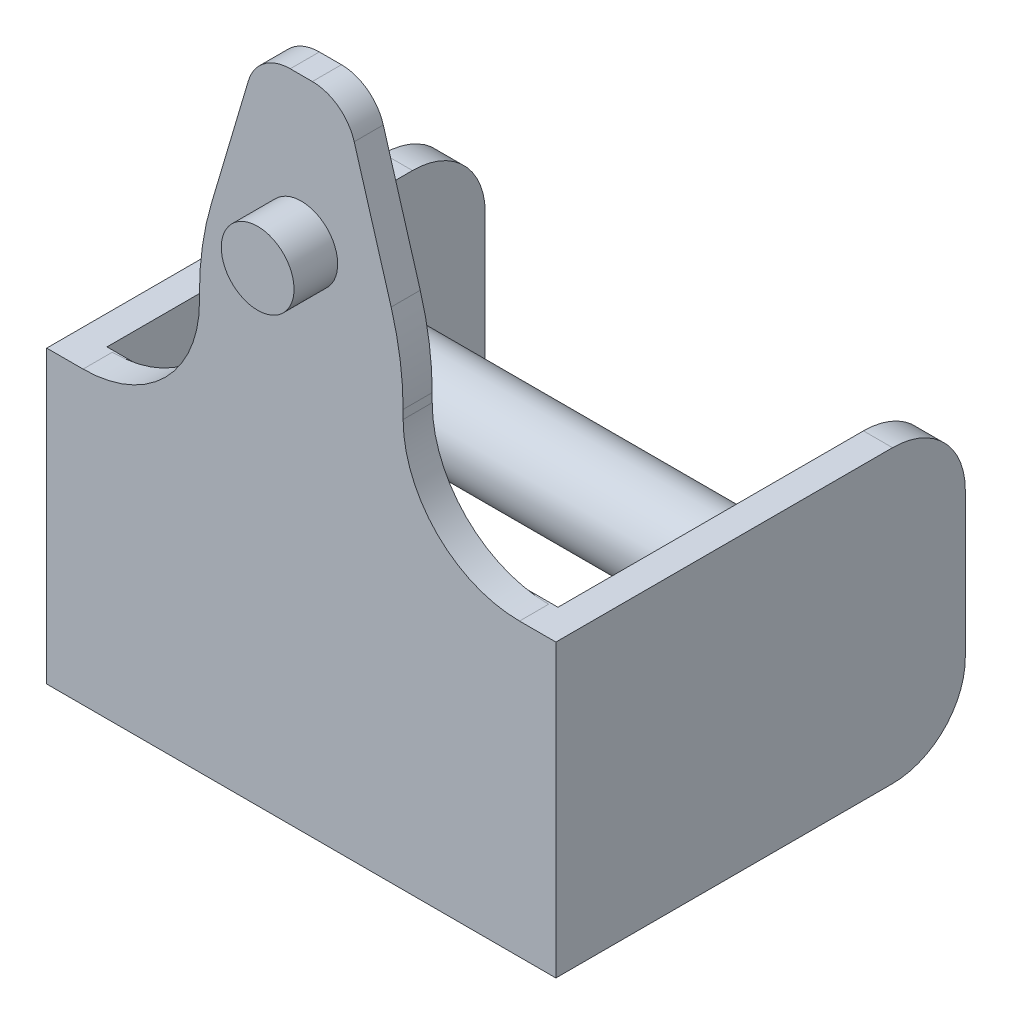
ISO-10303-21;
HEADER;
FILE_DESCRIPTION(('STEP AP214'),'2;1');
FILE_NAME('part.step','',(''),(''),'','','');
FILE_SCHEMA(('AUTOMOTIVE_DESIGN { 1 0 10303 214 1 1 1 1 }'));
ENDSEC;
DATA;
#1=APPLICATION_CONTEXT('core data for automotive mechanical design processes');
#2=APPLICATION_PROTOCOL_DEFINITION('international standard','automotive_design',2000,#1);
#3=PRODUCT_CONTEXT('',#1,'mechanical');
#4=PRODUCT('Part','Part','',(#3));
#5=PRODUCT_RELATED_PRODUCT_CATEGORY('part','',(#4));
#6=PRODUCT_DEFINITION_FORMATION('','',#4);
#7=PRODUCT_DEFINITION_CONTEXT('part definition',#1,'design');
#8=PRODUCT_DEFINITION('design','',#6,#7);
#9=PRODUCT_DEFINITION_SHAPE('','',#8);
#10=(LENGTH_UNIT() NAMED_UNIT(*) SI_UNIT(.MILLI.,.METRE.));
#11=(NAMED_UNIT(*) PLANE_ANGLE_UNIT() SI_UNIT($,.RADIAN.));
#12=(NAMED_UNIT(*) SI_UNIT($,.STERADIAN.) SOLID_ANGLE_UNIT());
#13=UNCERTAINTY_MEASURE_WITH_UNIT(LENGTH_MEASURE(1.E-05),#10,'distance_accuracy_value','');
#14=(GEOMETRIC_REPRESENTATION_CONTEXT(3) GLOBAL_UNCERTAINTY_ASSIGNED_CONTEXT((#13)) GLOBAL_UNIT_ASSIGNED_CONTEXT((#10,
#11,#12)) REPRESENTATION_CONTEXT('',''));
#15=CARTESIAN_POINT('',(0.,0.,0.));
#16=DIRECTION('',(0.,0.,1.));
#17=DIRECTION('',(1.,0.,0.));
#18=AXIS2_PLACEMENT_3D('',#15,#16,#17);
#19=CARTESIAN_POINT('',(-15.5,-10.,18.));
#20=DIRECTION('',(0.,0.,1.));
#21=DIRECTION('',(1.,0.,0.));
#22=AXIS2_PLACEMENT_3D('',#19,#20,#21);
#23=PLANE('',#22);
#24=DIRECTION('',(1.,0.,0.));
#25=VECTOR('',#24,1.);
#26=CARTESIAN_POINT('',(-15.5,10.,18.));
#27=LINE('',#26,#25);
#28=CARTESIAN_POINT('',(-15.5,10.,18.));
#29=VERTEX_POINT('',#28);
#30=CARTESIAN_POINT('',(15.5,10.,18.));
#31=VERTEX_POINT('',#30);
#32=EDGE_CURVE('E201',#29,#31,#27,.T.);
#33=ORIENTED_EDGE('',*,*,#32,.T.);
#34=DIRECTION('',(0.,1.,0.));
#35=VECTOR('',#34,1.);
#36=CARTESIAN_POINT('',(15.5,-10.,18.));
#37=LINE('',#36,#35);
#38=CARTESIAN_POINT('',(15.5,-10.,18.));
#39=VERTEX_POINT('',#38);
#40=EDGE_CURVE('E260',#39,#31,#37,.T.);
#41=ORIENTED_EDGE('',*,*,#40,.F.);
#42=DIRECTION('',(1.,0.,0.));
#43=VECTOR('',#42,1.);
#44=CARTESIAN_POINT('',(-15.5,-10.,18.));
#45=LINE('',#44,#43);
#46=CARTESIAN_POINT('',(-15.5,-10.,18.));
#47=VERTEX_POINT('',#46);
#48=EDGE_CURVE('E215',#47,#39,#45,.T.);
#49=ORIENTED_EDGE('',*,*,#48,.F.);
#50=DIRECTION('',(0.,1.,0.));
#51=VECTOR('',#50,1.);
#52=CARTESIAN_POINT('',(-15.5,-10.,18.));
#53=LINE('',#52,#51);
#54=EDGE_CURVE('E224',#47,#29,#53,.T.);
#55=ORIENTED_EDGE('',*,*,#54,.T.);
#56=EDGE_LOOP('',(#33,#41,#49,#55));
#57=FACE_BOUND('',#56,.T.);
#58=ADVANCED_FACE('F15',(#57),#23,.F.);
#59=CARTESIAN_POINT('',(15.5,-10.,0.));
#60=DIRECTION('',(1.,0.,0.));
#61=DIRECTION('',(0.,0.,-1.));
#62=AXIS2_PLACEMENT_3D('',#59,#60,#61);
#63=PLANE('',#62);
#64=CARTESIAN_POINT('',(15.5,0.,0.));
#65=DIRECTION('',(1.,0.,0.));
#66=DIRECTION('',(0.,0.,-1.));
#67=AXIS2_PLACEMENT_3D('',#64,#65,#66);
#68=CIRCLE('',#67,3.025);
#69=CARTESIAN_POINT('',(15.5,0.,-3.025));
#70=VERTEX_POINT('',#69);
#71=EDGE_CURVE('E263',#70,#70,#68,.F.);
#72=ORIENTED_EDGE('',*,*,#71,.F.);
#73=EDGE_LOOP('',(#72));
#74=FACE_BOUND('',#73,.T.);
#75=DIRECTION('',(0.,1.,0.));
#76=VECTOR('',#75,1.);
#77=CARTESIAN_POINT('',(15.5,-10.,-8.));
#78=LINE('',#77,#76);
#79=CARTESIAN_POINT('',(15.5,-5.,-8.));
#80=VERTEX_POINT('',#79);
#81=CARTESIAN_POINT('',(15.5,5.,-8.));
#82=VERTEX_POINT('',#81);
#83=EDGE_CURVE('E258',#80,#82,#78,.T.);
#84=ORIENTED_EDGE('',*,*,#83,.F.);
#85=CARTESIAN_POINT('',(15.5,-5.,-3.));
#86=DIRECTION('',(1.,0.,0.));
#87=DIRECTION('',(0.,0.,-1.));
#88=AXIS2_PLACEMENT_3D('',#85,#86,#87);
#89=CIRCLE('',#88,5.);
#90=CARTESIAN_POINT('',(15.5,-10.,-3.));
#91=VERTEX_POINT('',#90);
#92=EDGE_CURVE('E287',#80,#91,#89,.F.);
#93=ORIENTED_EDGE('',*,*,#92,.T.);
#94=DIRECTION('',(0.,0.,-1.));
#95=VECTOR('',#94,1.);
#96=CARTESIAN_POINT('',(15.5,-10.,18.));
#97=LINE('',#96,#95);
#98=EDGE_CURVE('E211',#39,#91,#97,.T.);
#99=ORIENTED_EDGE('',*,*,#98,.F.);
#100=ORIENTED_EDGE('',*,*,#40,.T.);
#101=DIRECTION('',(0.,0.,-1.));
#102=VECTOR('',#101,1.);
#103=CARTESIAN_POINT('',(15.5,10.,0.));
#104=LINE('',#103,#102);
#105=CARTESIAN_POINT('',(15.5,10.,-3.));
#106=VERTEX_POINT('',#105);
#107=EDGE_CURVE('E205',#31,#106,#104,.T.);
#108=ORIENTED_EDGE('',*,*,#107,.T.);
#109=CARTESIAN_POINT('',(15.5,5.,-3.));
#110=DIRECTION('',(1.,0.,0.));
#111=DIRECTION('',(0.,0.,-1.));
#112=AXIS2_PLACEMENT_3D('',#109,#110,#111);
#113=CIRCLE('',#112,5.);
#114=EDGE_CURVE('E277',#106,#82,#113,.F.);
#115=ORIENTED_EDGE('',*,*,#114,.T.);
#116=EDGE_LOOP('',(#84,#93,#99,#100,#108,#115));
#117=FACE_BOUND('',#116,.T.);
#118=ADVANCED_FACE('F455',(#74,#117),#63,.F.);
#119=CARTESIAN_POINT('',(15.5,-10.,-8.));
#120=DIRECTION('',(0.,0.,1.));
#121=DIRECTION('',(1.,0.,0.));
#122=AXIS2_PLACEMENT_3D('',#119,#120,#121);
#123=PLANE('',#122);
#124=DIRECTION('',(0.,1.,0.));
#125=VECTOR('',#124,1.);
#126=CARTESIAN_POINT('',(17.5,-10.,-8.));
#127=LINE('',#126,#125);
#128=CARTESIAN_POINT('',(17.5,-5.,-8.));
#129=VERTEX_POINT('',#128);
#130=CARTESIAN_POINT('',(17.5,5.,-8.));
#131=VERTEX_POINT('',#130);
#132=EDGE_CURVE('E256',#129,#131,#127,.T.);
#133=ORIENTED_EDGE('',*,*,#132,.F.);
#134=DIRECTION('',(1.,0.,0.));
#135=VECTOR('',#134,1.);
#136=CARTESIAN_POINT('',(15.5,-5.,-8.));
#137=LINE('',#136,#135);
#138=EDGE_CURVE('E285',#129,#80,#137,.F.);
#139=ORIENTED_EDGE('',*,*,#138,.T.);
#140=ORIENTED_EDGE('',*,*,#83,.T.);
#141=DIRECTION('',(1.,0.,0.));
#142=VECTOR('',#141,1.);
#143=CARTESIAN_POINT('',(17.5,5.,-8.));
#144=LINE('',#143,#142);
#145=EDGE_CURVE('E270',#82,#131,#144,.T.);
#146=ORIENTED_EDGE('',*,*,#145,.T.);
#147=EDGE_LOOP('',(#133,#139,#140,#146));
#148=FACE_BOUND('',#147,.T.);
#149=ADVANCED_FACE('F463',(#148),#123,.F.);
#150=CARTESIAN_POINT('',(17.5,-10.,18.));
#151=DIRECTION('',(-1.,0.,0.));
#152=DIRECTION('',(0.,0.,1.));
#153=AXIS2_PLACEMENT_3D('',#150,#151,#152);
#154=PLANE('',#153);
#155=DIRECTION('',(0.,0.,1.));
#156=VECTOR('',#155,1.);
#157=CARTESIAN_POINT('',(17.5,10.,18.));
#158=LINE('',#157,#156);
#159=CARTESIAN_POINT('',(17.5,10.,-3.));
#160=VERTEX_POINT('',#159);
#161=CARTESIAN_POINT('',(17.5,10.,20.1428278468085));
#162=VERTEX_POINT('',#161);
#163=EDGE_CURVE('E231',#160,#162,#158,.T.);
#164=ORIENTED_EDGE('',*,*,#163,.T.);
#165=DIRECTION('',(0.,1.,0.));
#166=VECTOR('',#165,1.);
#167=CARTESIAN_POINT('',(17.5,-10.,20.1428278468085));
#168=LINE('',#167,#166);
#169=CARTESIAN_POINT('',(17.5,-10.,20.1428278468085));
#170=VERTEX_POINT('',#169);
#171=EDGE_CURVE('E254',#170,#162,#168,.T.);
#172=ORIENTED_EDGE('',*,*,#171,.F.);
#173=DIRECTION('',(0.,0.,1.));
#174=VECTOR('',#173,1.);
#175=CARTESIAN_POINT('',(17.5,-10.,-8.));
#176=LINE('',#175,#174);
#177=CARTESIAN_POINT('',(17.5,-10.,-3.));
#178=VERTEX_POINT('',#177);
#179=EDGE_CURVE('E214',#178,#170,#176,.T.);
#180=ORIENTED_EDGE('',*,*,#179,.F.);
#181=CARTESIAN_POINT('',(17.5,-5.,-3.));
#182=DIRECTION('',(-1.,0.,0.));
#183=DIRECTION('',(0.,0.,1.));
#184=AXIS2_PLACEMENT_3D('',#181,#182,#183);
#185=CIRCLE('',#184,5.);
#186=EDGE_CURVE('E283',#178,#129,#185,.F.);
#187=ORIENTED_EDGE('',*,*,#186,.T.);
#188=ORIENTED_EDGE('',*,*,#132,.T.);
#189=CARTESIAN_POINT('',(17.5,5.,-3.));
#190=DIRECTION('',(-1.,0.,0.));
#191=DIRECTION('',(0.,0.,1.));
#192=AXIS2_PLACEMENT_3D('',#189,#190,#191);
#193=CIRCLE('',#192,5.);
#194=EDGE_CURVE('E273',#131,#160,#193,.F.);
#195=ORIENTED_EDGE('',*,*,#194,.T.);
#196=EDGE_LOOP('',(#164,#172,#180,#187,#188,#195));
#197=FACE_BOUND('',#196,.T.);
#198=ADVANCED_FACE('F446',(#197),#154,.F.);
#199=CARTESIAN_POINT('',(-17.5,-10.,20.1428278468085));
#200=DIRECTION('',(0.,0.,-1.));
#201=DIRECTION('',(-1.,0.,0.));
#202=AXIS2_PLACEMENT_3D('',#199,#200,#201);
#203=PLANE('',#202);
#204=CARTESIAN_POINT('',(0.,24.9999999999999,20.1428278468085));
#205=DIRECTION('',(0.,0.,-1.));
#206=DIRECTION('',(0.,-1.,0.));
#207=AXIS2_PLACEMENT_3D('',#204,#205,#206);
#208=CIRCLE('',#207,2.5);
#209=CARTESIAN_POINT('',(0.,22.4999999999999,20.1428278468085));
#210=VERTEX_POINT('',#209);
#211=EDGE_CURVE('E388',#210,#210,#208,.T.);
#212=ORIENTED_EDGE('',*,*,#211,.T.);
#213=EDGE_LOOP('',(#212));
#214=FACE_BOUND('',#213,.T.);
#215=DIRECTION('',(-1.,0.,0.));
#216=VECTOR('',#215,1.);
#217=CARTESIAN_POINT('',(-17.5,10.,20.1428278468085));
#218=LINE('',#217,#216);
#219=CARTESIAN_POINT('',(-15.,10.,20.1428278468085));
#220=VERTEX_POINT('',#219);
#221=CARTESIAN_POINT('',(-17.5,10.,20.1428278468085));
#222=VERTEX_POINT('',#221);
#223=EDGE_CURVE('E235',#220,#222,#218,.T.);
#224=ORIENTED_EDGE('',*,*,#223,.T.);
#225=DIRECTION('',(0.,1.,0.));
#226=VECTOR('',#225,1.);
#227=CARTESIAN_POINT('',(-17.5,-10.,20.1428278468085));
#228=LINE('',#227,#226);
#229=CARTESIAN_POINT('',(-17.5,-10.,20.1428278468085));
#230=VERTEX_POINT('',#229);
#231=EDGE_CURVE('E252',#230,#222,#228,.T.);
#232=ORIENTED_EDGE('',*,*,#231,.F.);
#233=DIRECTION('',(-1.,0.,0.));
#234=VECTOR('',#233,1.);
#235=CARTESIAN_POINT('',(-17.5,-10.,20.1428278468085));
#236=LINE('',#235,#234);
#237=EDGE_CURVE('E217',#170,#230,#236,.T.);
#238=ORIENTED_EDGE('',*,*,#237,.F.);
#239=ORIENTED_EDGE('',*,*,#171,.T.);
#240=CARTESIAN_POINT('',(15.,10.,20.1428278468085));
#241=VERTEX_POINT('',#240);
#242=EDGE_CURVE('E236',#162,#241,#218,.T.);
#243=ORIENTED_EDGE('',*,*,#242,.T.);
#244=CARTESIAN_POINT('',(15.,18.,20.1428278468085));
#245=DIRECTION('',(0.,0.,1.));
#246=DIRECTION('',(0.,1.,0.));
#247=AXIS2_PLACEMENT_3D('',#244,#245,#246);
#248=CIRCLE('',#247,8.);
#249=CARTESIAN_POINT('',(7.,18.,20.1428278468085));
#250=VERTEX_POINT('',#249);
#251=EDGE_CURVE('E352',#250,#241,#248,.T.);
#252=ORIENTED_EDGE('',*,*,#251,.F.);
#253=DIRECTION('',(0.,-1.,0.));
#254=VECTOR('',#253,1.);
#255=CARTESIAN_POINT('',(7.,21.5,20.1428278468085));
#256=LINE('',#255,#254);
#257=CARTESIAN_POINT('',(7.,18.5993607983564,20.1428278468085));
#258=VERTEX_POINT('',#257);
#259=EDGE_CURVE('E347',#258,#250,#256,.T.);
#260=ORIENTED_EDGE('',*,*,#259,.F.);
#261=CARTESIAN_POINT('',(-13.,18.5993607983564,20.1428278468085));
#262=DIRECTION('',(0.,0.,-1.));
#263=DIRECTION('',(0.,-1.,0.));
#264=AXIS2_PLACEMENT_3D('',#261,#262,#263);
#265=CIRCLE('',#264,20.);
#266=CARTESIAN_POINT('',(6.17596225416774,24.2811273921839,20.1428278468085));
#267=VERTEX_POINT('',#266);
#268=EDGE_CURVE('E200',#267,#258,#265,.T.);
#269=ORIENTED_EDGE('',*,*,#268,.F.);
#270=DIRECTION('',(0.284088329691376,-0.958798112708387,0.));
#271=VECTOR('',#270,1.);
#272=CARTESIAN_POINT('',(3.,34.9999999999999,20.1428278468085));
#273=LINE('',#272,#271);
#274=CARTESIAN_POINT('',(3.63636592916322,32.852264989074,20.1428278468085));
#275=VERTEX_POINT('',#274);
#276=EDGE_CURVE('E196',#275,#267,#273,.T.);
#277=ORIENTED_EDGE('',*,*,#276,.F.);
#278=CARTESIAN_POINT('',(0.759971591038062,31.9999999999999,20.1428278468085));
#279=DIRECTION('',(0.,0.,-1.));
#280=DIRECTION('',(0.,-1.,0.));
#281=AXIS2_PLACEMENT_3D('',#278,#279,#280);
#282=CIRCLE('',#281,3.);
#283=CARTESIAN_POINT('',(0.759971591038064,34.9999999999999,20.1428278468085));
#284=VERTEX_POINT('',#283);
#285=EDGE_CURVE('E380',#284,#275,#282,.T.);
#286=ORIENTED_EDGE('',*,*,#285,.F.);
#287=DIRECTION('',(1.,0.,0.));
#288=VECTOR('',#287,1.);
#289=CARTESIAN_POINT('',(0.,34.9999999999999,20.1428278468085));
#290=LINE('',#289,#288);
#291=CARTESIAN_POINT('',(-0.759971591038069,34.9999999999999,20.1428278468085));
#292=VERTEX_POINT('',#291);
#293=EDGE_CURVE('E376',#292,#284,#290,.T.);
#294=ORIENTED_EDGE('',*,*,#293,.F.);
#295=CARTESIAN_POINT('',(-0.759971591038069,31.9999999999999,20.1428278468085));
#296=DIRECTION('',(0.,0.,-1.));
#297=DIRECTION('',(0.,-1.,0.));
#298=AXIS2_PLACEMENT_3D('',#295,#296,#297);
#299=CIRCLE('',#298,3.);
#300=CARTESIAN_POINT('',(-3.63636592916323,32.852264989074,20.1428278468085));
#301=VERTEX_POINT('',#300);
#302=EDGE_CURVE('E371',#301,#292,#299,.T.);
#303=ORIENTED_EDGE('',*,*,#302,.F.);
#304=DIRECTION('',(0.284088329691375,0.958798112708387,0.));
#305=VECTOR('',#304,1.);
#306=CARTESIAN_POINT('',(-3.,34.9999999999999,20.1428278468085));
#307=LINE('',#306,#305);
#308=CARTESIAN_POINT('',(-6.17596225416773,24.2811273921839,20.1428278468085));
#309=VERTEX_POINT('',#308);
#310=EDGE_CURVE('E367',#309,#301,#307,.T.);
#311=ORIENTED_EDGE('',*,*,#310,.F.);
#312=CARTESIAN_POINT('',(13.,18.5993607983564,20.1428278468085));
#313=DIRECTION('',(0.,0.,-1.));
#314=DIRECTION('',(0.,-1.,0.));
#315=AXIS2_PLACEMENT_3D('',#312,#313,#314);
#316=CIRCLE('',#315,20.);
#317=CARTESIAN_POINT('',(-7.,18.5993607983564,20.1428278468085));
#318=VERTEX_POINT('',#317);
#319=EDGE_CURVE('E363',#318,#309,#316,.T.);
#320=ORIENTED_EDGE('',*,*,#319,.F.);
#321=DIRECTION('',(0.,1.,0.));
#322=VECTOR('',#321,1.);
#323=CARTESIAN_POINT('',(-7.,21.5,20.1428278468085));
#324=LINE('',#323,#322);
#325=CARTESIAN_POINT('',(-7.,18.,20.1428278468085));
#326=VERTEX_POINT('',#325);
#327=EDGE_CURVE('E359',#326,#318,#324,.T.);
#328=ORIENTED_EDGE('',*,*,#327,.F.);
#329=CARTESIAN_POINT('',(-15.,18.,20.1428278468085));
#330=DIRECTION('',(0.,0.,1.));
#331=DIRECTION('',(0.,1.,0.));
#332=AXIS2_PLACEMENT_3D('',#329,#330,#331);
#333=CIRCLE('',#332,8.);
#334=EDGE_CURVE('E30',#220,#326,#333,.T.);
#335=ORIENTED_EDGE('',*,*,#334,.F.);
#336=EDGE_LOOP('',(#224,#232,#238,#239,#243,#252,#260,#269,#277,#286,#294,#303,#311,#320,#328,#335));
#337=FACE_BOUND('',#336,.T.);
#338=ADVANCED_FACE('F336',(#214,#337),#203,.F.);
#339=CARTESIAN_POINT('',(-17.5,-10.,-8.));
#340=DIRECTION('',(1.,0.,0.));
#341=DIRECTION('',(0.,0.,-1.));
#342=AXIS2_PLACEMENT_3D('',#339,#340,#341);
#343=PLANE('',#342);
#344=ORIENTED_EDGE('',*,*,#231,.T.);
#345=DIRECTION('',(0.,0.,-1.));
#346=VECTOR('',#345,1.);
#347=CARTESIAN_POINT('',(-17.5,10.,-8.));
#348=LINE('',#347,#346);
#349=CARTESIAN_POINT('',(-17.5,10.,-3.));
#350=VERTEX_POINT('',#349);
#351=EDGE_CURVE('E38',#222,#350,#348,.T.);
#352=ORIENTED_EDGE('',*,*,#351,.T.);
#353=CARTESIAN_POINT('',(-17.5,5.,-3.));
#354=DIRECTION('',(1.,0.,0.));
#355=DIRECTION('',(0.,0.,-1.));
#356=AXIS2_PLACEMENT_3D('',#353,#354,#355);
#357=CIRCLE('',#356,5.);
#358=CARTESIAN_POINT('',(-17.5,5.,-8.));
#359=VERTEX_POINT('',#358);
#360=EDGE_CURVE('E23',#350,#359,#357,.F.);
#361=ORIENTED_EDGE('',*,*,#360,.T.);
#362=DIRECTION('',(0.,1.,0.));
#363=VECTOR('',#362,1.);
#364=CARTESIAN_POINT('',(-17.5,-10.,-8.));
#365=LINE('',#364,#363);
#366=CARTESIAN_POINT('',(-17.5,-5.,-8.));
#367=VERTEX_POINT('',#366);
#368=EDGE_CURVE('E249',#367,#359,#365,.T.);
#369=ORIENTED_EDGE('',*,*,#368,.F.);
#370=CARTESIAN_POINT('',(-17.5,-5.,-3.));
#371=DIRECTION('',(1.,0.,0.));
#372=DIRECTION('',(0.,0.,-1.));
#373=AXIS2_PLACEMENT_3D('',#370,#371,#372);
#374=CIRCLE('',#373,5.);
#375=CARTESIAN_POINT('',(-17.5,-10.,-3.));
#376=VERTEX_POINT('',#375);
#377=EDGE_CURVE('E296',#367,#376,#374,.F.);
#378=ORIENTED_EDGE('',*,*,#377,.T.);
#379=DIRECTION('',(0.,0.,-1.));
#380=VECTOR('',#379,1.);
#381=CARTESIAN_POINT('',(-17.5,-10.,18.));
#382=LINE('',#381,#380);
#383=EDGE_CURVE('E219',#230,#376,#382,.T.);
#384=ORIENTED_EDGE('',*,*,#383,.F.);
#385=EDGE_LOOP('',(#344,#352,#361,#369,#378,#384));
#386=FACE_BOUND('',#385,.T.);
#387=ADVANCED_FACE('F306',(#386),#343,.F.);
#388=CARTESIAN_POINT('',(-15.5,-10.,-8.));
#389=DIRECTION('',(0.,0.,1.));
#390=DIRECTION('',(1.,0.,0.));
#391=AXIS2_PLACEMENT_3D('',#388,#389,#390);
#392=PLANE('',#391);
#393=ORIENTED_EDGE('',*,*,#368,.T.);
#394=DIRECTION('',(1.,0.,0.));
#395=VECTOR('',#394,1.);
#396=CARTESIAN_POINT('',(-15.5,5.,-8.));
#397=LINE('',#396,#395);
#398=CARTESIAN_POINT('',(-15.5,5.,-8.));
#399=VERTEX_POINT('',#398);
#400=EDGE_CURVE('E298',#359,#399,#397,.T.);
#401=ORIENTED_EDGE('',*,*,#400,.T.);
#402=DIRECTION('',(0.,1.,0.));
#403=VECTOR('',#402,1.);
#404=CARTESIAN_POINT('',(-15.5,-10.,-8.));
#405=LINE('',#404,#403);
#406=CARTESIAN_POINT('',(-15.5,-5.,-8.));
#407=VERTEX_POINT('',#406);
#408=EDGE_CURVE('E246',#407,#399,#405,.T.);
#409=ORIENTED_EDGE('',*,*,#408,.F.);
#410=DIRECTION('',(1.,0.,0.));
#411=VECTOR('',#410,1.);
#412=CARTESIAN_POINT('',(-15.5,-5.,-8.));
#413=LINE('',#412,#411);
#414=EDGE_CURVE('E294',#407,#367,#413,.F.);
#415=ORIENTED_EDGE('',*,*,#414,.T.);
#416=EDGE_LOOP('',(#393,#401,#409,#415));
#417=FACE_BOUND('',#416,.T.);
#418=ADVANCED_FACE('F312',(#417),#392,.F.);
#419=CARTESIAN_POINT('',(-15.5,-10.,18.));
#420=DIRECTION('',(-1.,0.,0.));
#421=DIRECTION('',(0.,0.,1.));
#422=AXIS2_PLACEMENT_3D('',#419,#420,#421);
#423=PLANE('',#422);
#424=CARTESIAN_POINT('',(-15.5,0.,0.));
#425=DIRECTION('',(-1.,0.,0.));
#426=DIRECTION('',(0.,1.,0.));
#427=AXIS2_PLACEMENT_3D('',#424,#425,#426);
#428=CIRCLE('',#427,3.025);
#429=CARTESIAN_POINT('',(-15.5,3.025,0.));
#430=VERTEX_POINT('',#429);
#431=EDGE_CURVE('E266',#430,#430,#428,.T.);
#432=ORIENTED_EDGE('',*,*,#431,.T.);
#433=EDGE_LOOP('',(#432));
#434=FACE_BOUND('',#433,.T.);
#435=ORIENTED_EDGE('',*,*,#408,.T.);
#436=CARTESIAN_POINT('',(-15.5,5.,-3.));
#437=DIRECTION('',(-1.,0.,0.));
#438=DIRECTION('',(0.,0.,1.));
#439=AXIS2_PLACEMENT_3D('',#436,#437,#438);
#440=CIRCLE('',#439,5.);
#441=CARTESIAN_POINT('',(-15.5,10.,-3.));
#442=VERTEX_POINT('',#441);
#443=EDGE_CURVE('E301',#399,#442,#440,.F.);
#444=ORIENTED_EDGE('',*,*,#443,.T.);
#445=DIRECTION('',(0.,0.,1.));
#446=VECTOR('',#445,1.);
#447=CARTESIAN_POINT('',(-15.5,10.,18.));
#448=LINE('',#447,#446);
#449=EDGE_CURVE('E227',#442,#29,#448,.T.);
#450=ORIENTED_EDGE('',*,*,#449,.T.);
#451=ORIENTED_EDGE('',*,*,#54,.F.);
#452=DIRECTION('',(0.,0.,1.));
#453=VECTOR('',#452,1.);
#454=CARTESIAN_POINT('',(-15.5,-10.,0.));
#455=LINE('',#454,#453);
#456=CARTESIAN_POINT('',(-15.5,-10.,-3.));
#457=VERTEX_POINT('',#456);
#458=EDGE_CURVE('E222',#457,#47,#455,.T.);
#459=ORIENTED_EDGE('',*,*,#458,.F.);
#460=CARTESIAN_POINT('',(-15.5,-5.,-3.));
#461=DIRECTION('',(-1.,0.,0.));
#462=DIRECTION('',(0.,0.,1.));
#463=AXIS2_PLACEMENT_3D('',#460,#461,#462);
#464=CIRCLE('',#463,5.);
#465=EDGE_CURVE('E292',#457,#407,#464,.F.);
#466=ORIENTED_EDGE('',*,*,#465,.T.);
#467=EDGE_LOOP('',(#435,#444,#450,#451,#459,#466));
#468=FACE_BOUND('',#467,.T.);
#469=ADVANCED_FACE('F317',(#434,#468),#423,.F.);
#470=CARTESIAN_POINT('',(0.,-10.,0.));
#471=DIRECTION('',(0.,1.,0.));
#472=DIRECTION('',(0.,0.,1.));
#473=AXIS2_PLACEMENT_3D('',#470,#471,#472);
#474=PLANE('',#473);
#475=ORIENTED_EDGE('',*,*,#383,.T.);
#476=DIRECTION('',(1.,0.,0.));
#477=VECTOR('',#476,1.);
#478=CARTESIAN_POINT('',(0.,-10.,-3.));
#479=LINE('',#478,#477);
#480=EDGE_CURVE('E289',#376,#457,#479,.T.);
#481=ORIENTED_EDGE('',*,*,#480,.T.);
#482=ORIENTED_EDGE('',*,*,#458,.T.);
#483=ORIENTED_EDGE('',*,*,#48,.T.);
#484=ORIENTED_EDGE('',*,*,#98,.T.);
#485=DIRECTION('',(1.,0.,0.));
#486=VECTOR('',#485,1.);
#487=CARTESIAN_POINT('',(0.,-10.,-3.));
#488=LINE('',#487,#486);
#489=EDGE_CURVE('E280',#91,#178,#488,.T.);
#490=ORIENTED_EDGE('',*,*,#489,.T.);
#491=ORIENTED_EDGE('',*,*,#179,.T.);
#492=ORIENTED_EDGE('',*,*,#237,.T.);
#493=EDGE_LOOP('',(#475,#481,#482,#483,#484,#490,#491,#492));
#494=FACE_BOUND('',#493,.T.);
#495=ADVANCED_FACE('F328',(#494),#474,.F.);
#496=CARTESIAN_POINT('',(0.,10.,0.));
#497=DIRECTION('',(0.,1.,0.));
#498=DIRECTION('',(0.,0.,1.));
#499=AXIS2_PLACEMENT_3D('',#496,#497,#498);
#500=PLANE('',#499);
#501=DIRECTION('',(-1.,0.,0.));
#502=VECTOR('',#501,1.);
#503=CARTESIAN_POINT('',(0.,10.,18.1428278468085));
#504=LINE('',#503,#502);
#505=CARTESIAN_POINT('',(15.,10.,18.1428278468085));
#506=VERTEX_POINT('',#505);
#507=CARTESIAN_POINT('',(-15.,10.,18.1428278468085));
#508=VERTEX_POINT('',#507);
#509=EDGE_CURVE('E9',#506,#508,#504,.T.);
#510=ORIENTED_EDGE('',*,*,#509,.F.);
#511=DIRECTION('',(0.,0.,1.));
#512=VECTOR('',#511,1.);
#513=CARTESIAN_POINT('',(15.,10.,18.1428278468085));
#514=LINE('',#513,#512);
#515=EDGE_CURVE('E207',#506,#241,#514,.T.);
#516=ORIENTED_EDGE('',*,*,#515,.T.);
#517=ORIENTED_EDGE('',*,*,#242,.F.);
#518=ORIENTED_EDGE('',*,*,#163,.F.);
#519=DIRECTION('',(1.,0.,0.));
#520=VECTOR('',#519,1.);
#521=CARTESIAN_POINT('',(15.5,10.,-3.));
#522=LINE('',#521,#520);
#523=EDGE_CURVE('E275',#160,#106,#522,.F.);
#524=ORIENTED_EDGE('',*,*,#523,.T.);
#525=ORIENTED_EDGE('',*,*,#107,.F.);
#526=ORIENTED_EDGE('',*,*,#32,.F.);
#527=ORIENTED_EDGE('',*,*,#449,.F.);
#528=DIRECTION('',(1.,0.,0.));
#529=VECTOR('',#528,1.);
#530=CARTESIAN_POINT('',(-17.5,10.,-3.));
#531=LINE('',#530,#529);
#532=EDGE_CURVE('E303',#442,#350,#531,.F.);
#533=ORIENTED_EDGE('',*,*,#532,.T.);
#534=ORIENTED_EDGE('',*,*,#351,.F.);
#535=ORIENTED_EDGE('',*,*,#223,.F.);
#536=DIRECTION('',(0.,0.,1.));
#537=VECTOR('',#536,1.);
#538=CARTESIAN_POINT('',(-15.,10.,18.1428278468085));
#539=LINE('',#538,#537);
#540=EDGE_CURVE('E436',#508,#220,#539,.T.);
#541=ORIENTED_EDGE('',*,*,#540,.F.);
#542=EDGE_LOOP('',(#510,#516,#517,#518,#524,#525,#526,#527,#533,#534,#535,#541));
#543=FACE_BOUND('',#542,.T.);
#544=ADVANCED_FACE('F322',(#543),#500,.T.);
#545=CARTESIAN_POINT('',(15.5,0.,0.));
#546=DIRECTION('',(-1.,0.,0.));
#547=DIRECTION('',(0.,0.,1.));
#548=AXIS2_PLACEMENT_3D('',#545,#546,#547);
#549=CYLINDRICAL_SURFACE('',#548,3.025);
#550=ORIENTED_EDGE('',*,*,#71,.T.);
#551=EDGE_LOOP('',(#550));
#552=FACE_BOUND('',#551,.T.);
#553=ORIENTED_EDGE('',*,*,#431,.F.);
#554=EDGE_LOOP('',(#553));
#555=FACE_BOUND('',#554,.T.);
#556=ADVANCED_FACE('F479',(#552,#555),#549,.T.);
#557=CARTESIAN_POINT('',(15.5,5.,-3.));
#558=DIRECTION('',(-1.,0.,0.));
#559=DIRECTION('',(0.,0.,1.));
#560=AXIS2_PLACEMENT_3D('',#557,#558,#559);
#561=CYLINDRICAL_SURFACE('',#560,5.);
#562=ORIENTED_EDGE('',*,*,#114,.F.);
#563=ORIENTED_EDGE('',*,*,#523,.F.);
#564=ORIENTED_EDGE('',*,*,#194,.F.);
#565=ORIENTED_EDGE('',*,*,#145,.F.);
#566=EDGE_LOOP('',(#562,#563,#564,#565));
#567=FACE_BOUND('',#566,.T.);
#568=ADVANCED_FACE('F451',(#567),#561,.T.);
#569=CARTESIAN_POINT('',(0.,-5.,-3.));
#570=DIRECTION('',(1.,0.,0.));
#571=DIRECTION('',(0.,0.,-1.));
#572=AXIS2_PLACEMENT_3D('',#569,#570,#571);
#573=CYLINDRICAL_SURFACE('',#572,5.);
#574=ORIENTED_EDGE('',*,*,#92,.F.);
#575=ORIENTED_EDGE('',*,*,#138,.F.);
#576=ORIENTED_EDGE('',*,*,#186,.F.);
#577=ORIENTED_EDGE('',*,*,#489,.F.);
#578=EDGE_LOOP('',(#574,#575,#576,#577));
#579=FACE_BOUND('',#578,.T.);
#580=ADVANCED_FACE('F459',(#579),#573,.T.);
#581=CARTESIAN_POINT('',(0.,-5.,-3.));
#582=DIRECTION('',(1.,0.,0.));
#583=DIRECTION('',(0.,0.,-1.));
#584=AXIS2_PLACEMENT_3D('',#581,#582,#583);
#585=CYLINDRICAL_SURFACE('',#584,5.);
#586=ORIENTED_EDGE('',*,*,#377,.F.);
#587=ORIENTED_EDGE('',*,*,#414,.F.);
#588=ORIENTED_EDGE('',*,*,#465,.F.);
#589=ORIENTED_EDGE('',*,*,#480,.F.);
#590=EDGE_LOOP('',(#586,#587,#588,#589));
#591=FACE_BOUND('',#590,.T.);
#592=ADVANCED_FACE('F332',(#591),#585,.T.);
#593=CARTESIAN_POINT('',(-15.5,5.,-3.));
#594=DIRECTION('',(-1.,0.,0.));
#595=DIRECTION('',(0.,0.,1.));
#596=AXIS2_PLACEMENT_3D('',#593,#594,#595);
#597=CYLINDRICAL_SURFACE('',#596,5.);
#598=ORIENTED_EDGE('',*,*,#360,.F.);
#599=ORIENTED_EDGE('',*,*,#532,.F.);
#600=ORIENTED_EDGE('',*,*,#443,.F.);
#601=ORIENTED_EDGE('',*,*,#400,.F.);
#602=EDGE_LOOP('',(#598,#599,#600,#601));
#603=FACE_BOUND('',#602,.T.);
#604=ADVANCED_FACE('F17',(#603),#597,.T.);
#605=CARTESIAN_POINT('',(-13.,18.5993607983564,18.1428278468085));
#606=DIRECTION('',(0.,0.,1.));
#607=DIRECTION('',(1.,0.,0.));
#608=AXIS2_PLACEMENT_3D('',#605,#606,#607);
#609=CYLINDRICAL_SURFACE('',#608,20.);
#610=ORIENTED_EDGE('',*,*,#268,.T.);
#611=DIRECTION('',(0.,0.,1.));
#612=VECTOR('',#611,1.);
#613=CARTESIAN_POINT('',(7.,18.5993607983564,18.1428278468085));
#614=LINE('',#613,#612);
#615=CARTESIAN_POINT('',(7.,18.5993607983564,18.1428278468085));
#616=VERTEX_POINT('',#615);
#617=EDGE_CURVE('E180',#616,#258,#614,.T.);
#618=ORIENTED_EDGE('',*,*,#617,.F.);
#619=CARTESIAN_POINT('',(-13.,18.5993607983564,18.1428278468085));
#620=DIRECTION('',(0.,0.,-1.));
#621=DIRECTION('',(0.,-1.,0.));
#622=AXIS2_PLACEMENT_3D('',#619,#620,#621);
#623=CIRCLE('',#622,20.);
#624=CARTESIAN_POINT('',(6.17596225416774,24.2811273921839,18.1428278468085));
#625=VERTEX_POINT('',#624);
#626=EDGE_CURVE('E187',#625,#616,#623,.T.);
#627=ORIENTED_EDGE('',*,*,#626,.F.);
#628=DIRECTION('',(0.,0.,1.));
#629=VECTOR('',#628,1.);
#630=CARTESIAN_POINT('',(6.17596225416774,24.2811273921839,18.1428278468085));
#631=LINE('',#630,#629);
#632=EDGE_CURVE('E412',#625,#267,#631,.T.);
#633=ORIENTED_EDGE('',*,*,#632,.T.);
#634=EDGE_LOOP('',(#610,#618,#627,#633));
#635=FACE_BOUND('',#634,.T.);
#636=ADVANCED_FACE('F198',(#635),#609,.T.);
#637=CARTESIAN_POINT('',(7.,21.5,18.1428278468085));
#638=DIRECTION('',(-1.,0.,0.));
#639=DIRECTION('',(0.,0.,1.));
#640=AXIS2_PLACEMENT_3D('',#637,#638,#639);
#641=PLANE('',#640);
#642=ORIENTED_EDGE('',*,*,#259,.T.);
#643=DIRECTION('',(0.,0.,1.));
#644=VECTOR('',#643,1.);
#645=CARTESIAN_POINT('',(7.,18.,18.1428278468085));
#646=LINE('',#645,#644);
#647=CARTESIAN_POINT('',(7.,18.,18.1428278468085));
#648=VERTEX_POINT('',#647);
#649=EDGE_CURVE('E183',#648,#250,#646,.T.);
#650=ORIENTED_EDGE('',*,*,#649,.F.);
#651=DIRECTION('',(0.,-1.,0.));
#652=VECTOR('',#651,1.);
#653=CARTESIAN_POINT('',(7.,21.5,18.1428278468085));
#654=LINE('',#653,#652);
#655=EDGE_CURVE('E176',#616,#648,#654,.T.);
#656=ORIENTED_EDGE('',*,*,#655,.F.);
#657=ORIENTED_EDGE('',*,*,#617,.T.);
#658=EDGE_LOOP('',(#642,#650,#656,#657));
#659=FACE_BOUND('',#658,.T.);
#660=ADVANCED_FACE('F178',(#659),#641,.F.);
#661=CARTESIAN_POINT('',(15.,18.,18.1428278468085));
#662=DIRECTION('',(0.,0.,1.));
#663=DIRECTION('',(1.,0.,0.));
#664=AXIS2_PLACEMENT_3D('',#661,#662,#663);
#665=CYLINDRICAL_SURFACE('',#664,8.);
#666=ORIENTED_EDGE('',*,*,#251,.T.);
#667=ORIENTED_EDGE('',*,*,#515,.F.);
#668=CARTESIAN_POINT('',(15.,18.,18.1428278468085));
#669=DIRECTION('',(0.,0.,1.));
#670=DIRECTION('',(0.,1.,0.));
#671=AXIS2_PLACEMENT_3D('',#668,#669,#670);
#672=CIRCLE('',#671,8.);
#673=EDGE_CURVE('E186',#648,#506,#672,.T.);
#674=ORIENTED_EDGE('',*,*,#673,.F.);
#675=ORIENTED_EDGE('',*,*,#649,.T.);
#676=EDGE_LOOP('',(#666,#667,#674,#675));
#677=FACE_BOUND('',#676,.T.);
#678=ADVANCED_FACE('F497',(#677),#665,.F.);
#679=CARTESIAN_POINT('',(-15.,18.,18.1428278468085));
#680=DIRECTION('',(0.,0.,1.));
#681=DIRECTION('',(1.,0.,0.));
#682=AXIS2_PLACEMENT_3D('',#679,#680,#681);
#683=CYLINDRICAL_SURFACE('',#682,8.);
#684=ORIENTED_EDGE('',*,*,#334,.T.);
#685=DIRECTION('',(0.,0.,1.));
#686=VECTOR('',#685,1.);
#687=CARTESIAN_POINT('',(-7.,18.,18.1428278468085));
#688=LINE('',#687,#686);
#689=CARTESIAN_POINT('',(-7.,18.,18.1428278468085));
#690=VERTEX_POINT('',#689);
#691=EDGE_CURVE('E433',#690,#326,#688,.T.);
#692=ORIENTED_EDGE('',*,*,#691,.F.);
#693=CARTESIAN_POINT('',(-15.,18.,18.1428278468085));
#694=DIRECTION('',(0.,0.,1.));
#695=DIRECTION('',(0.,1.,0.));
#696=AXIS2_PLACEMENT_3D('',#693,#694,#695);
#697=CIRCLE('',#696,8.);
#698=EDGE_CURVE('E398',#508,#690,#697,.T.);
#699=ORIENTED_EDGE('',*,*,#698,.F.);
#700=ORIENTED_EDGE('',*,*,#540,.T.);
#701=EDGE_LOOP('',(#684,#692,#699,#700));
#702=FACE_BOUND('',#701,.T.);
#703=ADVANCED_FACE('F586',(#702),#683,.F.);
#704=CARTESIAN_POINT('',(-7.,21.5,18.1428278468085));
#705=DIRECTION('',(1.,0.,0.));
#706=DIRECTION('',(0.,0.,-1.));
#707=AXIS2_PLACEMENT_3D('',#704,#705,#706);
#708=PLANE('',#707);
#709=ORIENTED_EDGE('',*,*,#327,.T.);
#710=DIRECTION('',(0.,0.,1.));
#711=VECTOR('',#710,1.);
#712=CARTESIAN_POINT('',(-7.,18.5993607983564,18.1428278468085));
#713=LINE('',#712,#711);
#714=CARTESIAN_POINT('',(-7.,18.5993607983564,18.1428278468085));
#715=VERTEX_POINT('',#714);
#716=EDGE_CURVE('E430',#715,#318,#713,.T.);
#717=ORIENTED_EDGE('',*,*,#716,.F.);
#718=DIRECTION('',(0.,1.,0.));
#719=VECTOR('',#718,1.);
#720=CARTESIAN_POINT('',(-7.,21.5,18.1428278468085));
#721=LINE('',#720,#719);
#722=EDGE_CURVE('E400',#690,#715,#721,.T.);
#723=ORIENTED_EDGE('',*,*,#722,.F.);
#724=ORIENTED_EDGE('',*,*,#691,.T.);
#725=EDGE_LOOP('',(#709,#717,#723,#724));
#726=FACE_BOUND('',#725,.T.);
#727=ADVANCED_FACE('F595',(#726),#708,.F.);
#728=CARTESIAN_POINT('',(13.,18.5993607983564,18.1428278468085));
#729=DIRECTION('',(0.,0.,1.));
#730=DIRECTION('',(1.,0.,0.));
#731=AXIS2_PLACEMENT_3D('',#728,#729,#730);
#732=CYLINDRICAL_SURFACE('',#731,20.);
#733=ORIENTED_EDGE('',*,*,#319,.T.);
#734=DIRECTION('',(0.,0.,1.));
#735=VECTOR('',#734,1.);
#736=CARTESIAN_POINT('',(-6.17596225416773,24.2811273921839,18.1428278468085));
#737=LINE('',#736,#735);
#738=CARTESIAN_POINT('',(-6.17596225416773,24.2811273921839,18.1428278468085));
#739=VERTEX_POINT('',#738);
#740=EDGE_CURVE('E427',#739,#309,#737,.T.);
#741=ORIENTED_EDGE('',*,*,#740,.F.);
#742=CARTESIAN_POINT('',(13.,18.5993607983564,18.1428278468085));
#743=DIRECTION('',(0.,0.,-1.));
#744=DIRECTION('',(0.,-1.,0.));
#745=AXIS2_PLACEMENT_3D('',#742,#743,#744);
#746=CIRCLE('',#745,20.);
#747=EDGE_CURVE('E402',#715,#739,#746,.T.);
#748=ORIENTED_EDGE('',*,*,#747,.F.);
#749=ORIENTED_EDGE('',*,*,#716,.T.);
#750=EDGE_LOOP('',(#733,#741,#748,#749));
#751=FACE_BOUND('',#750,.T.);
#752=ADVANCED_FACE('F606',(#751),#732,.T.);
#753=CARTESIAN_POINT('',(-3.,34.9999999999999,18.1428278468085));
#754=DIRECTION('',(0.958798112708387,-0.284088329691375,0.));
#755=DIRECTION('',(0.284088329691375,0.958798112708387,0.));
#756=AXIS2_PLACEMENT_3D('',#753,#754,#755);
#757=PLANE('',#756);
#758=ORIENTED_EDGE('',*,*,#310,.T.);
#759=DIRECTION('',(0.,0.,1.));
#760=VECTOR('',#759,1.);
#761=CARTESIAN_POINT('',(-3.63636592916323,32.852264989074,18.1428278468085));
#762=LINE('',#761,#760);
#763=CARTESIAN_POINT('',(-3.63636592916323,32.852264989074,18.1428278468085));
#764=VERTEX_POINT('',#763);
#765=EDGE_CURVE('E424',#764,#301,#762,.T.);
#766=ORIENTED_EDGE('',*,*,#765,.F.);
#767=DIRECTION('',(0.284088329691375,0.958798112708387,0.));
#768=VECTOR('',#767,1.);
#769=CARTESIAN_POINT('',(-3.,34.9999999999999,18.1428278468085));
#770=LINE('',#769,#768);
#771=EDGE_CURVE('E404',#739,#764,#770,.T.);
#772=ORIENTED_EDGE('',*,*,#771,.F.);
#773=ORIENTED_EDGE('',*,*,#740,.T.);
#774=EDGE_LOOP('',(#758,#766,#772,#773));
#775=FACE_BOUND('',#774,.T.);
#776=ADVANCED_FACE('F617',(#775),#757,.F.);
#777=CARTESIAN_POINT('',(-0.759971591038069,31.9999999999999,18.1428278468085));
#778=DIRECTION('',(0.,0.,1.));
#779=DIRECTION('',(1.,0.,0.));
#780=AXIS2_PLACEMENT_3D('',#777,#778,#779);
#781=CYLINDRICAL_SURFACE('',#780,3.);
#782=ORIENTED_EDGE('',*,*,#302,.T.);
#783=DIRECTION('',(0.,0.,1.));
#784=VECTOR('',#783,1.);
#785=CARTESIAN_POINT('',(-0.759971591038069,34.9999999999999,18.1428278468085));
#786=LINE('',#785,#784);
#787=CARTESIAN_POINT('',(-0.759971591038069,34.9999999999999,18.1428278468085));
#788=VERTEX_POINT('',#787);
#789=EDGE_CURVE('E421',#788,#292,#786,.T.);
#790=ORIENTED_EDGE('',*,*,#789,.F.);
#791=CARTESIAN_POINT('',(-0.759971591038069,31.9999999999999,18.1428278468085));
#792=DIRECTION('',(0.,0.,-1.));
#793=DIRECTION('',(0.,-1.,0.));
#794=AXIS2_PLACEMENT_3D('',#791,#792,#793);
#795=CIRCLE('',#794,3.);
#796=EDGE_CURVE('E406',#764,#788,#795,.T.);
#797=ORIENTED_EDGE('',*,*,#796,.F.);
#798=ORIENTED_EDGE('',*,*,#765,.T.);
#799=EDGE_LOOP('',(#782,#790,#797,#798));
#800=FACE_BOUND('',#799,.T.);
#801=ADVANCED_FACE('F628',(#800),#781,.T.);
#802=CARTESIAN_POINT('',(0.,34.9999999999999,18.1428278468085));
#803=DIRECTION('',(0.,-1.,0.));
#804=DIRECTION('',(0.,0.,-1.));
#805=AXIS2_PLACEMENT_3D('',#802,#803,#804);
#806=PLANE('',#805);
#807=ORIENTED_EDGE('',*,*,#293,.T.);
#808=DIRECTION('',(0.,0.,1.));
#809=VECTOR('',#808,1.);
#810=CARTESIAN_POINT('',(0.759971591038064,34.9999999999999,18.1428278468085));
#811=LINE('',#810,#809);
#812=CARTESIAN_POINT('',(0.759971591038064,34.9999999999999,18.1428278468085));
#813=VERTEX_POINT('',#812);
#814=EDGE_CURVE('E418',#813,#284,#811,.T.);
#815=ORIENTED_EDGE('',*,*,#814,.F.);
#816=DIRECTION('',(1.,0.,0.));
#817=VECTOR('',#816,1.);
#818=CARTESIAN_POINT('',(0.,34.9999999999999,18.1428278468085));
#819=LINE('',#818,#817);
#820=EDGE_CURVE('E408',#788,#813,#819,.T.);
#821=ORIENTED_EDGE('',*,*,#820,.F.);
#822=ORIENTED_EDGE('',*,*,#789,.T.);
#823=EDGE_LOOP('',(#807,#815,#821,#822));
#824=FACE_BOUND('',#823,.T.);
#825=ADVANCED_FACE('F639',(#824),#806,.F.);
#826=CARTESIAN_POINT('',(0.759971591038062,31.9999999999999,18.1428278468085));
#827=DIRECTION('',(0.,0.,1.));
#828=DIRECTION('',(1.,0.,0.));
#829=AXIS2_PLACEMENT_3D('',#826,#827,#828);
#830=CYLINDRICAL_SURFACE('',#829,3.);
#831=ORIENTED_EDGE('',*,*,#285,.T.);
#832=DIRECTION('',(0.,0.,1.));
#833=VECTOR('',#832,1.);
#834=CARTESIAN_POINT('',(3.63636592916322,32.852264989074,18.1428278468085));
#835=LINE('',#834,#833);
#836=CARTESIAN_POINT('',(3.63636592916322,32.852264989074,18.1428278468085));
#837=VERTEX_POINT('',#836);
#838=EDGE_CURVE('E415',#837,#275,#835,.T.);
#839=ORIENTED_EDGE('',*,*,#838,.F.);
#840=CARTESIAN_POINT('',(0.759971591038062,31.9999999999999,18.1428278468085));
#841=DIRECTION('',(0.,0.,-1.));
#842=DIRECTION('',(0.,-1.,0.));
#843=AXIS2_PLACEMENT_3D('',#840,#841,#842);
#844=CIRCLE('',#843,3.);
#845=EDGE_CURVE('E410',#813,#837,#844,.T.);
#846=ORIENTED_EDGE('',*,*,#845,.F.);
#847=ORIENTED_EDGE('',*,*,#814,.T.);
#848=EDGE_LOOP('',(#831,#839,#846,#847));
#849=FACE_BOUND('',#848,.T.);
#850=ADVANCED_FACE('F650',(#849),#830,.T.);
#851=CARTESIAN_POINT('',(3.,34.9999999999999,18.1428278468085));
#852=DIRECTION('',(-0.958798112708387,-0.284088329691376,0.));
#853=DIRECTION('',(0.284088329691376,-0.958798112708387,0.));
#854=AXIS2_PLACEMENT_3D('',#851,#852,#853);
#855=PLANE('',#854);
#856=ORIENTED_EDGE('',*,*,#276,.T.);
#857=ORIENTED_EDGE('',*,*,#632,.F.);
#858=DIRECTION('',(0.284088329691376,-0.958798112708387,0.));
#859=VECTOR('',#858,1.);
#860=CARTESIAN_POINT('',(3.,34.9999999999999,18.1428278468085));
#861=LINE('',#860,#859);
#862=EDGE_CURVE('E192',#837,#625,#861,.T.);
#863=ORIENTED_EDGE('',*,*,#862,.F.);
#864=ORIENTED_EDGE('',*,*,#838,.T.);
#865=EDGE_LOOP('',(#856,#857,#863,#864));
#866=FACE_BOUND('',#865,.T.);
#867=ADVANCED_FACE('F661',(#866),#855,.F.);
#868=CARTESIAN_POINT('',(-13.,18.5993607983564,18.1428278468085));
#869=DIRECTION('',(0.,0.,-1.));
#870=DIRECTION('',(-1.,0.,0.));
#871=AXIS2_PLACEMENT_3D('',#868,#869,#870);
#872=PLANE('',#871);
#873=ORIENTED_EDGE('',*,*,#673,.T.);
#874=ORIENTED_EDGE('',*,*,#509,.T.);
#875=ORIENTED_EDGE('',*,*,#698,.T.);
#876=ORIENTED_EDGE('',*,*,#722,.T.);
#877=ORIENTED_EDGE('',*,*,#747,.T.);
#878=ORIENTED_EDGE('',*,*,#771,.T.);
#879=ORIENTED_EDGE('',*,*,#796,.T.);
#880=ORIENTED_EDGE('',*,*,#820,.T.);
#881=ORIENTED_EDGE('',*,*,#845,.T.);
#882=ORIENTED_EDGE('',*,*,#862,.T.);
#883=ORIENTED_EDGE('',*,*,#626,.T.);
#884=ORIENTED_EDGE('',*,*,#655,.T.);
#885=EDGE_LOOP('',(#873,#874,#875,#876,#877,#878,#879,#880,#881,#882,#883,#884));
#886=FACE_BOUND('',#885,.T.);
#887=ADVANCED_FACE('F190',(#886),#872,.T.);
#888=CARTESIAN_POINT('',(0.,24.9999999999999,23.1428278468085));
#889=DIRECTION('',(0.,0.,-1.));
#890=DIRECTION('',(-1.,0.,0.));
#891=AXIS2_PLACEMENT_3D('',#888,#889,#890);
#892=CYLINDRICAL_SURFACE('',#891,2.5);
#893=CARTESIAN_POINT('',(0.,24.9999999999999,23.1428278468085));
#894=DIRECTION('',(0.,0.,-1.));
#895=DIRECTION('',(0.,-1.,0.));
#896=AXIS2_PLACEMENT_3D('',#893,#894,#895);
#897=CIRCLE('',#896,2.5);
#898=CARTESIAN_POINT('',(0.,22.4999999999999,23.1428278468085));
#899=VERTEX_POINT('',#898);
#900=EDGE_CURVE('E348',#899,#899,#897,.T.);
#901=ORIENTED_EDGE('',*,*,#900,.T.);
#902=EDGE_LOOP('',(#901));
#903=FACE_BOUND('',#902,.T.);
#904=ORIENTED_EDGE('',*,*,#211,.F.);
#905=EDGE_LOOP('',(#904));
#906=FACE_BOUND('',#905,.T.);
#907=ADVANCED_FACE('F682',(#903,#906),#892,.T.);
#908=CARTESIAN_POINT('',(0.,24.9999999999999,23.1428278468085));
#909=DIRECTION('',(0.,0.,-1.));
#910=DIRECTION('',(-1.,0.,0.));
#911=AXIS2_PLACEMENT_3D('',#908,#909,#910);
#912=PLANE('',#911);
#913=ORIENTED_EDGE('',*,*,#900,.F.);
#914=EDGE_LOOP('',(#913));
#915=FACE_BOUND('',#914,.T.);
#916=ADVANCED_FACE('F692',(#915),#912,.F.);
#917=CLOSED_SHELL('',(#58,#118,#149,#198,#338,#387,#418,#469,#495,#544,#556,#568,#580,#592,#604,
#636,#660,#678,#703,#727,#752,#776,#801,#825,#850,#867,#887,#907,#916));
#918=MANIFOLD_SOLID_BREP('B1',#917);
#919=ADVANCED_BREP_SHAPE_REPRESENTATION('',(#18,#918),#14);
#920=SHAPE_DEFINITION_REPRESENTATION(#9,#919);
ENDSEC;
END-ISO-10303-21;
